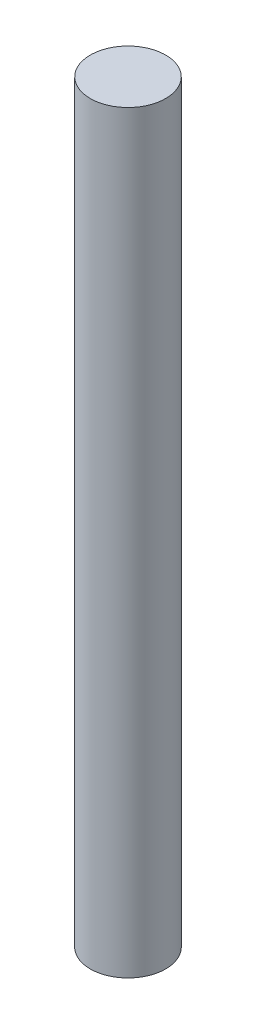
ISO-10303-21;
HEADER;
FILE_DESCRIPTION(('STEP AP214'),'2;1');
FILE_NAME('part.step','',(''),(''),'','','');
FILE_SCHEMA(('AUTOMOTIVE_DESIGN { 1 0 10303 214 1 1 1 1 }'));
ENDSEC;
DATA;
#1=APPLICATION_CONTEXT('core data for automotive mechanical design processes');
#2=APPLICATION_PROTOCOL_DEFINITION('international standard','automotive_design',2000,#1);
#3=PRODUCT_CONTEXT('',#1,'mechanical');
#4=PRODUCT('Part','Part','',(#3));
#5=PRODUCT_RELATED_PRODUCT_CATEGORY('part','',(#4));
#6=PRODUCT_DEFINITION_FORMATION('','',#4);
#7=PRODUCT_DEFINITION_CONTEXT('part definition',#1,'design');
#8=PRODUCT_DEFINITION('design','',#6,#7);
#9=PRODUCT_DEFINITION_SHAPE('','',#8);
#10=(LENGTH_UNIT() NAMED_UNIT(*) SI_UNIT(.MILLI.,.METRE.));
#11=(NAMED_UNIT(*) PLANE_ANGLE_UNIT() SI_UNIT($,.RADIAN.));
#12=(NAMED_UNIT(*) SI_UNIT($,.STERADIAN.) SOLID_ANGLE_UNIT());
#13=UNCERTAINTY_MEASURE_WITH_UNIT(LENGTH_MEASURE(1.E-05),#10,'distance_accuracy_value','');
#14=(GEOMETRIC_REPRESENTATION_CONTEXT(3) GLOBAL_UNCERTAINTY_ASSIGNED_CONTEXT((#13)) GLOBAL_UNIT_ASSIGNED_CONTEXT((#10,
#11,#12)) REPRESENTATION_CONTEXT('',''));
#15=CARTESIAN_POINT('',(0.,0.,0.));
#16=DIRECTION('',(0.,0.,1.));
#17=DIRECTION('',(1.,0.,0.));
#18=AXIS2_PLACEMENT_3D('',#15,#16,#17);
#19=CARTESIAN_POINT('',(0.,25.4,0.));
#20=DIRECTION('',(0.,-1.,0.));
#21=DIRECTION('',(0.,0.,-1.));
#22=AXIS2_PLACEMENT_3D('',#19,#20,#21);
#23=CYLINDRICAL_SURFACE('',#22,1.27);
#24=CARTESIAN_POINT('',(0.,25.4,0.));
#25=DIRECTION('',(0.,1.,0.));
#26=DIRECTION('',(0.,0.,1.));
#27=AXIS2_PLACEMENT_3D('',#24,#25,#26);
#28=CIRCLE('',#27,1.27);
#29=CARTESIAN_POINT('',(0.,25.4,1.27));
#30=VERTEX_POINT('',#29);
#31=EDGE_CURVE('E10',#30,#30,#28,.T.);
#32=ORIENTED_EDGE('',*,*,#31,.F.);
#33=EDGE_LOOP('',(#32));
#34=FACE_BOUND('',#33,.T.);
#35=CARTESIAN_POINT('',(0.,0.,0.));
#36=DIRECTION('',(0.,1.,0.));
#37=DIRECTION('',(0.,0.,1.));
#38=AXIS2_PLACEMENT_3D('',#35,#36,#37);
#39=CIRCLE('',#38,1.27);
#40=CARTESIAN_POINT('',(0.,0.,1.27));
#41=VERTEX_POINT('',#40);
#42=EDGE_CURVE('E34',#41,#41,#39,.T.);
#43=ORIENTED_EDGE('',*,*,#42,.T.);
#44=EDGE_LOOP('',(#43));
#45=FACE_BOUND('',#44,.T.);
#46=ADVANCED_FACE('F31',(#34,#45),#23,.T.);
#47=CARTESIAN_POINT('',(0.,25.4,0.));
#48=DIRECTION('',(0.,1.,0.));
#49=DIRECTION('',(0.,0.,1.));
#50=AXIS2_PLACEMENT_3D('',#47,#48,#49);
#51=PLANE('',#50);
#52=ORIENTED_EDGE('',*,*,#31,.T.);
#53=EDGE_LOOP('',(#52));
#54=FACE_BOUND('',#53,.T.);
#55=ADVANCED_FACE('F46',(#54),#51,.T.);
#56=CARTESIAN_POINT('',(0.,0.,0.));
#57=DIRECTION('',(0.,1.,0.));
#58=DIRECTION('',(0.,0.,1.));
#59=AXIS2_PLACEMENT_3D('',#56,#57,#58);
#60=PLANE('',#59);
#61=ORIENTED_EDGE('',*,*,#42,.F.);
#62=EDGE_LOOP('',(#61));
#63=FACE_BOUND('',#62,.T.);
#64=ADVANCED_FACE('F44',(#63),#60,.F.);
#65=CLOSED_SHELL('',(#46,#55,#64));
#66=MANIFOLD_SOLID_BREP('B2',#65);
#67=ADVANCED_BREP_SHAPE_REPRESENTATION('',(#18,#66),#14);
#68=SHAPE_DEFINITION_REPRESENTATION(#9,#67);
ENDSEC;
END-ISO-10303-21;
